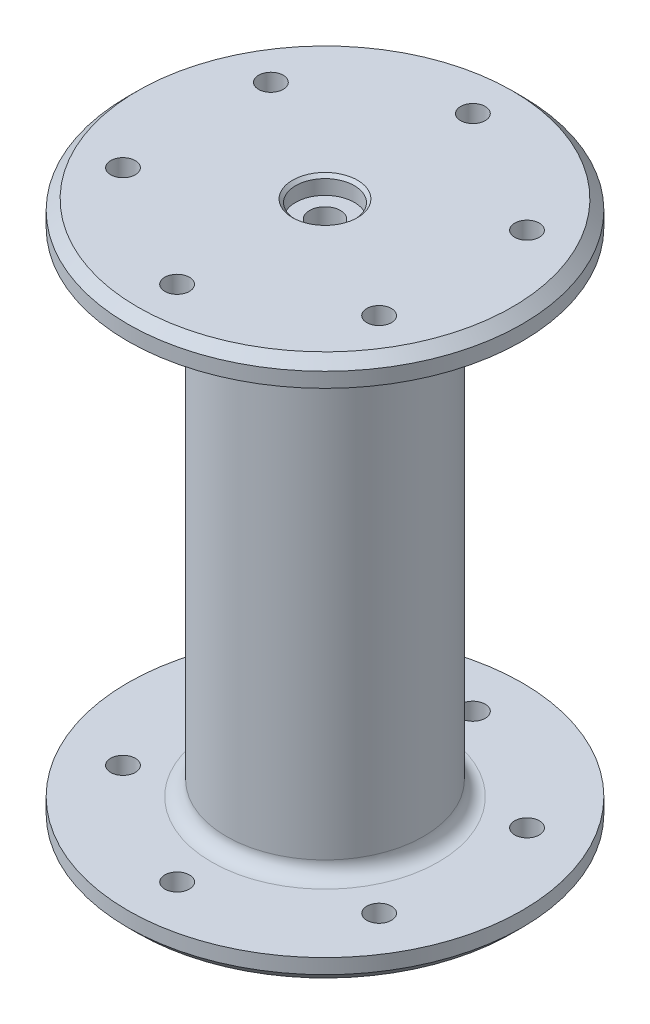
ISO-10303-21;
HEADER;
FILE_DESCRIPTION(('STEP AP214'),'2;1');
FILE_NAME('part.step','',(''),(''),'','','');
FILE_SCHEMA(('AUTOMOTIVE_DESIGN { 1 0 10303 214 1 1 1 1 }'));
ENDSEC;
DATA;
#1=APPLICATION_CONTEXT('core data for automotive mechanical design processes');
#2=APPLICATION_PROTOCOL_DEFINITION('international standard','automotive_design',2000,#1);
#3=PRODUCT_CONTEXT('',#1,'mechanical');
#4=PRODUCT('Part','Part','',(#3));
#5=PRODUCT_RELATED_PRODUCT_CATEGORY('part','',(#4));
#6=PRODUCT_DEFINITION_FORMATION('','',#4);
#7=PRODUCT_DEFINITION_CONTEXT('part definition',#1,'design');
#8=PRODUCT_DEFINITION('design','',#6,#7);
#9=PRODUCT_DEFINITION_SHAPE('','',#8);
#10=(LENGTH_UNIT() NAMED_UNIT(*) SI_UNIT(.MILLI.,.METRE.));
#11=(NAMED_UNIT(*) PLANE_ANGLE_UNIT() SI_UNIT($,.RADIAN.));
#12=(NAMED_UNIT(*) SI_UNIT($,.STERADIAN.) SOLID_ANGLE_UNIT());
#13=UNCERTAINTY_MEASURE_WITH_UNIT(LENGTH_MEASURE(1.E-05),#10,'distance_accuracy_value','');
#14=(GEOMETRIC_REPRESENTATION_CONTEXT(3) GLOBAL_UNCERTAINTY_ASSIGNED_CONTEXT((#13)) GLOBAL_UNIT_ASSIGNED_CONTEXT((#10,
#11,#12)) REPRESENTATION_CONTEXT('',''));
#15=CARTESIAN_POINT('',(0.,0.,0.));
#16=DIRECTION('',(0.,0.,1.));
#17=DIRECTION('',(1.,0.,0.));
#18=AXIS2_PLACEMENT_3D('',#15,#16,#17);
#19=CARTESIAN_POINT('',(0.,50.,0.));
#20=DIRECTION('',(0.,-1.,0.));
#21=DIRECTION('',(0.,0.,-1.));
#22=AXIS2_PLACEMENT_3D('',#19,#20,#21);
#23=CYLINDRICAL_SURFACE('',#22,20.);
#24=CARTESIAN_POINT('',(0.,-47.,0.));
#25=DIRECTION('',(0.,-1.,0.));
#26=DIRECTION('',(0.,0.,-1.));
#27=AXIS2_PLACEMENT_3D('',#24,#25,#26);
#28=CIRCLE('',#27,20.);
#29=CARTESIAN_POINT('',(0.,-47.,-20.));
#30=VERTEX_POINT('',#29);
#31=EDGE_CURVE('E46',#30,#30,#28,.F.);
#32=ORIENTED_EDGE('',*,*,#31,.T.);
#33=EDGE_LOOP('',(#32));
#34=FACE_BOUND('',#33,.T.);
#35=CARTESIAN_POINT('',(0.,47.,0.));
#36=DIRECTION('',(0.,1.,0.));
#37=DIRECTION('',(0.,0.,1.));
#38=AXIS2_PLACEMENT_3D('',#35,#36,#37);
#39=CIRCLE('',#38,20.);
#40=CARTESIAN_POINT('',(0.,47.,20.));
#41=VERTEX_POINT('',#40);
#42=EDGE_CURVE('E196',#41,#41,#39,.F.);
#43=ORIENTED_EDGE('',*,*,#42,.T.);
#44=EDGE_LOOP('',(#43));
#45=FACE_BOUND('',#44,.T.);
#46=ADVANCED_FACE('F37',(#34,#45),#23,.T.);
#47=CARTESIAN_POINT('',(0.,55.,0.));
#48=DIRECTION('',(0.,-1.,0.));
#49=DIRECTION('',(0.,0.,-1.));
#50=AXIS2_PLACEMENT_3D('',#47,#48,#49);
#51=CYLINDRICAL_SURFACE('',#50,40.);
#52=CARTESIAN_POINT('',(0.,53.,0.));
#53=DIRECTION('',(0.,1.,0.));
#54=DIRECTION('',(0.,0.,1.));
#55=AXIS2_PLACEMENT_3D('',#52,#53,#54);
#56=CIRCLE('',#55,40.);
#57=CARTESIAN_POINT('',(0.,53.,40.));
#58=VERTEX_POINT('',#57);
#59=EDGE_CURVE('E170',#58,#58,#56,.F.);
#60=ORIENTED_EDGE('',*,*,#59,.T.);
#61=EDGE_LOOP('',(#60));
#62=FACE_BOUND('',#61,.T.);
#63=CARTESIAN_POINT('',(0.,50.,0.));
#64=DIRECTION('',(0.,1.,0.));
#65=DIRECTION('',(0.,0.,1.));
#66=AXIS2_PLACEMENT_3D('',#63,#64,#65);
#67=CIRCLE('',#66,40.);
#68=CARTESIAN_POINT('',(0.,50.,40.));
#69=VERTEX_POINT('',#68);
#70=EDGE_CURVE('E162',#69,#69,#67,.T.);
#71=ORIENTED_EDGE('',*,*,#70,.T.);
#72=EDGE_LOOP('',(#71));
#73=FACE_BOUND('',#72,.T.);
#74=ADVANCED_FACE('F239',(#62,#73),#51,.T.);
#75=CARTESIAN_POINT('',(0.,55.,0.));
#76=DIRECTION('',(0.,1.,0.));
#77=DIRECTION('',(0.,0.,1.));
#78=AXIS2_PLACEMENT_3D('',#75,#76,#77);
#79=PLANE('',#78);
#80=CARTESIAN_POINT('',(0.,55.,0.));
#81=DIRECTION('',(0.,1.,0.));
#82=DIRECTION('',(0.,0.,1.));
#83=AXIS2_PLACEMENT_3D('',#80,#81,#82);
#84=CIRCLE('',#83,6.58876);
#85=CARTESIAN_POINT('',(0.,55.,6.58876));
#86=VERTEX_POINT('',#85);
#87=EDGE_CURVE('E120',#86,#86,#84,.T.);
#88=ORIENTED_EDGE('',*,*,#87,.F.);
#89=EDGE_LOOP('',(#88));
#90=FACE_BOUND('',#89,.T.);
#91=CARTESIAN_POINT('',(-25.980762113533,55.,-15.0000000000003));
#92=DIRECTION('',(0.,1.,0.));
#93=DIRECTION('',(0.,0.,1.));
#94=AXIS2_PLACEMENT_3D('',#91,#92,#93);
#95=CIRCLE('',#94,2.5);
#96=CARTESIAN_POINT('',(-25.980762113533,55.,-12.5000000000003));
#97=VERTEX_POINT('',#96);
#98=EDGE_CURVE('E153',#97,#97,#95,.F.);
#99=ORIENTED_EDGE('',*,*,#98,.T.);
#100=EDGE_LOOP('',(#99));
#101=FACE_BOUND('',#100,.T.);
#102=CARTESIAN_POINT('',(-25.9807621135333,55.,14.9999999999998));
#103=DIRECTION('',(0.,1.,0.));
#104=DIRECTION('',(0.,0.,1.));
#105=AXIS2_PLACEMENT_3D('',#102,#103,#104);
#106=CIRCLE('',#105,2.5);
#107=CARTESIAN_POINT('',(-25.9807621135333,55.,17.4999999999998));
#108=VERTEX_POINT('',#107);
#109=EDGE_CURVE('E148',#108,#108,#106,.F.);
#110=ORIENTED_EDGE('',*,*,#109,.T.);
#111=EDGE_LOOP('',(#110));
#112=FACE_BOUND('',#111,.T.);
#113=CARTESIAN_POINT('',(0.,55.,30.));
#114=DIRECTION('',(0.,1.,0.));
#115=DIRECTION('',(0.,0.,1.));
#116=AXIS2_PLACEMENT_3D('',#113,#114,#115);
#117=CIRCLE('',#116,2.5);
#118=CARTESIAN_POINT('',(0.,55.,32.5));
#119=VERTEX_POINT('',#118);
#120=EDGE_CURVE('E143',#119,#119,#117,.F.);
#121=ORIENTED_EDGE('',*,*,#120,.T.);
#122=EDGE_LOOP('',(#121));
#123=FACE_BOUND('',#122,.T.);
#124=CARTESIAN_POINT('',(25.9807621135331,55.,15.0000000000001));
#125=DIRECTION('',(0.,1.,0.));
#126=DIRECTION('',(0.,0.,1.));
#127=AXIS2_PLACEMENT_3D('',#124,#125,#126);
#128=CIRCLE('',#127,2.5);
#129=CARTESIAN_POINT('',(25.9807621135331,55.,17.5000000000001));
#130=VERTEX_POINT('',#129);
#131=EDGE_CURVE('E138',#130,#130,#128,.F.);
#132=ORIENTED_EDGE('',*,*,#131,.T.);
#133=EDGE_LOOP('',(#132));
#134=FACE_BOUND('',#133,.T.);
#135=CARTESIAN_POINT('',(25.9807621135332,55.,-14.9999999999999));
#136=DIRECTION('',(0.,1.,0.));
#137=DIRECTION('',(0.,0.,1.));
#138=AXIS2_PLACEMENT_3D('',#135,#136,#137);
#139=CIRCLE('',#138,2.5);
#140=CARTESIAN_POINT('',(25.9807621135332,55.,-12.4999999999999));
#141=VERTEX_POINT('',#140);
#142=EDGE_CURVE('E133',#141,#141,#139,.F.);
#143=ORIENTED_EDGE('',*,*,#142,.T.);
#144=EDGE_LOOP('',(#143));
#145=FACE_BOUND('',#144,.T.);
#146=CARTESIAN_POINT('',(0.,55.,-30.));
#147=DIRECTION('',(0.,1.,0.));
#148=DIRECTION('',(0.,0.,1.));
#149=AXIS2_PLACEMENT_3D('',#146,#147,#148);
#150=CIRCLE('',#149,2.5);
#151=CARTESIAN_POINT('',(0.,55.,-27.5));
#152=VERTEX_POINT('',#151);
#153=EDGE_CURVE('E158',#152,#152,#150,.F.);
#154=ORIENTED_EDGE('',*,*,#153,.T.);
#155=EDGE_LOOP('',(#154));
#156=FACE_BOUND('',#155,.T.);
#157=CARTESIAN_POINT('',(0.,55.,0.));
#158=DIRECTION('',(0.,1.,0.));
#159=DIRECTION('',(0.,0.,1.));
#160=AXIS2_PLACEMENT_3D('',#157,#158,#159);
#161=CIRCLE('',#160,38.);
#162=CARTESIAN_POINT('',(0.,55.,38.));
#163=VERTEX_POINT('',#162);
#164=EDGE_CURVE('E166',#163,#163,#161,.T.);
#165=ORIENTED_EDGE('',*,*,#164,.T.);
#166=EDGE_LOOP('',(#165));
#167=FACE_BOUND('',#166,.T.);
#168=ADVANCED_FACE('F245',(#90,#101,#112,#123,#134,#145,#156,#167),#79,.T.);
#169=CARTESIAN_POINT('',(0.,50.,0.));
#170=DIRECTION('',(0.,1.,0.));
#171=DIRECTION('',(0.,0.,1.));
#172=AXIS2_PLACEMENT_3D('',#169,#170,#171);
#173=PLANE('',#172);
#174=CARTESIAN_POINT('',(0.,50.,0.));
#175=DIRECTION('',(0.,1.,0.));
#176=DIRECTION('',(0.,0.,1.));
#177=AXIS2_PLACEMENT_3D('',#174,#175,#176);
#178=CIRCLE('',#177,23.);
#179=CARTESIAN_POINT('',(0.,50.,23.));
#180=VERTEX_POINT('',#179);
#181=EDGE_CURVE('E174',#180,#180,#178,.T.);
#182=ORIENTED_EDGE('',*,*,#181,.T.);
#183=EDGE_LOOP('',(#182));
#184=FACE_BOUND('',#183,.T.);
#185=CARTESIAN_POINT('',(-25.980762113533,50.,-15.0000000000003));
#186=DIRECTION('',(0.,1.,0.));
#187=DIRECTION('',(0.,0.,1.));
#188=AXIS2_PLACEMENT_3D('',#185,#186,#187);
#189=CIRCLE('',#188,2.5);
#190=CARTESIAN_POINT('',(-25.980762113533,50.,-12.5000000000003));
#191=VERTEX_POINT('',#190);
#192=EDGE_CURVE('E152',#191,#191,#189,.F.);
#193=ORIENTED_EDGE('',*,*,#192,.F.);
#194=EDGE_LOOP('',(#193));
#195=FACE_BOUND('',#194,.T.);
#196=CARTESIAN_POINT('',(-25.9807621135333,50.,14.9999999999998));
#197=DIRECTION('',(0.,1.,0.));
#198=DIRECTION('',(0.,0.,1.));
#199=AXIS2_PLACEMENT_3D('',#196,#197,#198);
#200=CIRCLE('',#199,2.5);
#201=CARTESIAN_POINT('',(-25.9807621135333,50.,17.4999999999998));
#202=VERTEX_POINT('',#201);
#203=EDGE_CURVE('E147',#202,#202,#200,.F.);
#204=ORIENTED_EDGE('',*,*,#203,.F.);
#205=EDGE_LOOP('',(#204));
#206=FACE_BOUND('',#205,.T.);
#207=CARTESIAN_POINT('',(0.,50.,30.));
#208=DIRECTION('',(0.,1.,0.));
#209=DIRECTION('',(0.,0.,1.));
#210=AXIS2_PLACEMENT_3D('',#207,#208,#209);
#211=CIRCLE('',#210,2.5);
#212=CARTESIAN_POINT('',(0.,50.,32.5));
#213=VERTEX_POINT('',#212);
#214=EDGE_CURVE('E142',#213,#213,#211,.F.);
#215=ORIENTED_EDGE('',*,*,#214,.F.);
#216=EDGE_LOOP('',(#215));
#217=FACE_BOUND('',#216,.T.);
#218=CARTESIAN_POINT('',(25.9807621135331,50.,15.0000000000001));
#219=DIRECTION('',(0.,1.,0.));
#220=DIRECTION('',(0.,0.,1.));
#221=AXIS2_PLACEMENT_3D('',#218,#219,#220);
#222=CIRCLE('',#221,2.5);
#223=CARTESIAN_POINT('',(25.9807621135331,50.,17.5000000000001));
#224=VERTEX_POINT('',#223);
#225=EDGE_CURVE('E137',#224,#224,#222,.F.);
#226=ORIENTED_EDGE('',*,*,#225,.F.);
#227=EDGE_LOOP('',(#226));
#228=FACE_BOUND('',#227,.T.);
#229=CARTESIAN_POINT('',(25.9807621135332,50.,-14.9999999999999));
#230=DIRECTION('',(0.,1.,0.));
#231=DIRECTION('',(0.,0.,1.));
#232=AXIS2_PLACEMENT_3D('',#229,#230,#231);
#233=CIRCLE('',#232,2.5);
#234=CARTESIAN_POINT('',(25.9807621135332,50.,-12.4999999999999));
#235=VERTEX_POINT('',#234);
#236=EDGE_CURVE('E132',#235,#235,#233,.F.);
#237=ORIENTED_EDGE('',*,*,#236,.F.);
#238=EDGE_LOOP('',(#237));
#239=FACE_BOUND('',#238,.T.);
#240=CARTESIAN_POINT('',(0.,50.,-30.));
#241=DIRECTION('',(0.,1.,0.));
#242=DIRECTION('',(0.,0.,1.));
#243=AXIS2_PLACEMENT_3D('',#240,#241,#242);
#244=CIRCLE('',#243,2.5);
#245=CARTESIAN_POINT('',(0.,50.,-27.5));
#246=VERTEX_POINT('',#245);
#247=EDGE_CURVE('E157',#246,#246,#244,.F.);
#248=ORIENTED_EDGE('',*,*,#247,.F.);
#249=EDGE_LOOP('',(#248));
#250=FACE_BOUND('',#249,.T.);
#251=ORIENTED_EDGE('',*,*,#70,.F.);
#252=EDGE_LOOP('',(#251));
#253=FACE_BOUND('',#252,.T.);
#254=ADVANCED_FACE('F255',(#184,#195,#206,#217,#228,#239,#250,#253),#173,.F.);
#255=CARTESIAN_POINT('',(0.,55.,0.));
#256=DIRECTION('',(0.,-1.,0.));
#257=DIRECTION('',(0.,0.,-1.));
#258=AXIS2_PLACEMENT_3D('',#255,#256,#257);
#259=CONICAL_SURFACE('',#258,38.,0.78539816339744);
#260=ORIENTED_EDGE('',*,*,#59,.F.);
#261=EDGE_LOOP('',(#260));
#262=FACE_BOUND('',#261,.T.);
#263=ORIENTED_EDGE('',*,*,#164,.F.);
#264=EDGE_LOOP('',(#263));
#265=FACE_BOUND('',#264,.T.);
#266=ADVANCED_FACE('F251',(#262,#265),#259,.T.);
#267=CARTESIAN_POINT('',(0.,450.,-30.));
#268=DIRECTION('',(0.,-1.,0.));
#269=DIRECTION('',(0.,0.,-1.));
#270=AXIS2_PLACEMENT_3D('',#267,#268,#269);
#271=CYLINDRICAL_SURFACE('',#270,2.5);
#272=ORIENTED_EDGE('',*,*,#153,.F.);
#273=EDGE_LOOP('',(#272));
#274=FACE_BOUND('',#273,.T.);
#275=ORIENTED_EDGE('',*,*,#247,.T.);
#276=EDGE_LOOP('',(#275));
#277=FACE_BOUND('',#276,.T.);
#278=ADVANCED_FACE('F254',(#274,#277),#271,.F.);
#279=CARTESIAN_POINT('',(25.9807621135332,450.,-14.9999999999999));
#280=DIRECTION('',(0.,-1.,0.));
#281=DIRECTION('',(0.,0.,-1.));
#282=AXIS2_PLACEMENT_3D('',#279,#280,#281);
#283=CYLINDRICAL_SURFACE('',#282,2.5);
#284=ORIENTED_EDGE('',*,*,#142,.F.);
#285=EDGE_LOOP('',(#284));
#286=FACE_BOUND('',#285,.T.);
#287=ORIENTED_EDGE('',*,*,#236,.T.);
#288=EDGE_LOOP('',(#287));
#289=FACE_BOUND('',#288,.T.);
#290=ADVANCED_FACE('F294',(#286,#289),#283,.F.);
#291=CARTESIAN_POINT('',(25.9807621135331,450.,15.0000000000001));
#292=DIRECTION('',(0.,-1.,0.));
#293=DIRECTION('',(0.,0.,-1.));
#294=AXIS2_PLACEMENT_3D('',#291,#292,#293);
#295=CYLINDRICAL_SURFACE('',#294,2.5);
#296=ORIENTED_EDGE('',*,*,#131,.F.);
#297=EDGE_LOOP('',(#296));
#298=FACE_BOUND('',#297,.T.);
#299=ORIENTED_EDGE('',*,*,#225,.T.);
#300=EDGE_LOOP('',(#299));
#301=FACE_BOUND('',#300,.T.);
#302=ADVANCED_FACE('F300',(#298,#301),#295,.F.);
#303=CARTESIAN_POINT('',(0.,450.,30.));
#304=DIRECTION('',(0.,-1.,0.));
#305=DIRECTION('',(0.,0.,-1.));
#306=AXIS2_PLACEMENT_3D('',#303,#304,#305);
#307=CYLINDRICAL_SURFACE('',#306,2.5);
#308=ORIENTED_EDGE('',*,*,#120,.F.);
#309=EDGE_LOOP('',(#308));
#310=FACE_BOUND('',#309,.T.);
#311=ORIENTED_EDGE('',*,*,#214,.T.);
#312=EDGE_LOOP('',(#311));
#313=FACE_BOUND('',#312,.T.);
#314=ADVANCED_FACE('F328',(#310,#313),#307,.F.);
#315=CARTESIAN_POINT('',(-25.9807621135333,450.,14.9999999999998));
#316=DIRECTION('',(0.,-1.,0.));
#317=DIRECTION('',(0.,0.,-1.));
#318=AXIS2_PLACEMENT_3D('',#315,#316,#317);
#319=CYLINDRICAL_SURFACE('',#318,2.5);
#320=ORIENTED_EDGE('',*,*,#109,.F.);
#321=EDGE_LOOP('',(#320));
#322=FACE_BOUND('',#321,.T.);
#323=ORIENTED_EDGE('',*,*,#203,.T.);
#324=EDGE_LOOP('',(#323));
#325=FACE_BOUND('',#324,.T.);
#326=ADVANCED_FACE('F269',(#322,#325),#319,.F.);
#327=CARTESIAN_POINT('',(-25.980762113533,450.,-15.0000000000003));
#328=DIRECTION('',(0.,-1.,0.));
#329=DIRECTION('',(0.,0.,-1.));
#330=AXIS2_PLACEMENT_3D('',#327,#328,#329);
#331=CYLINDRICAL_SURFACE('',#330,2.5);
#332=ORIENTED_EDGE('',*,*,#98,.F.);
#333=EDGE_LOOP('',(#332));
#334=FACE_BOUND('',#333,.T.);
#335=ORIENTED_EDGE('',*,*,#192,.T.);
#336=EDGE_LOOP('',(#335));
#337=FACE_BOUND('',#336,.T.);
#338=ADVANCED_FACE('F260',(#334,#337),#331,.F.);
#339=CARTESIAN_POINT('',(0.,47.,0.));
#340=DIRECTION('',(0.,1.,0.));
#341=DIRECTION('',(0.,0.,1.));
#342=AXIS2_PLACEMENT_3D('',#339,#340,#341);
#343=TOROIDAL_SURFACE('',#342,23.,3.);
#344=ORIENTED_EDGE('',*,*,#42,.F.);
#345=EDGE_LOOP('',(#344));
#346=FACE_BOUND('',#345,.T.);
#347=ORIENTED_EDGE('',*,*,#181,.F.);
#348=EDGE_LOOP('',(#347));
#349=FACE_BOUND('',#348,.T.);
#350=ADVANCED_FACE('F257',(#346,#349),#343,.F.);
#351=CARTESIAN_POINT('',(3.1242,51.4186,0.));
#352=DIRECTION('',(0.,-1.,0.));
#353=DIRECTION('',(0.,0.,-1.));
#354=AXIS2_PLACEMENT_3D('',#351,#352,#353);
#355=PLANE('',#354);
#356=CARTESIAN_POINT('',(0.,51.4186,0.));
#357=DIRECTION('',(0.,-1.,0.));
#358=DIRECTION('',(0.,0.,-1.));
#359=AXIS2_PLACEMENT_3D('',#356,#357,#358);
#360=CIRCLE('',#359,3.125);
#361=CARTESIAN_POINT('',(0.,51.4186,-3.125));
#362=VERTEX_POINT('',#361);
#363=EDGE_CURVE('E119',#362,#362,#360,.T.);
#364=ORIENTED_EDGE('',*,*,#363,.T.);
#365=EDGE_LOOP('',(#364));
#366=FACE_BOUND('',#365,.T.);
#367=CARTESIAN_POINT('',(0.,51.4186,0.));
#368=DIRECTION('',(0.,1.,0.));
#369=DIRECTION('',(0.,0.,1.));
#370=AXIS2_PLACEMENT_3D('',#367,#368,#369);
#371=CIRCLE('',#370,5.95376);
#372=CARTESIAN_POINT('',(0.,51.4186,5.95376));
#373=VERTEX_POINT('',#372);
#374=EDGE_CURVE('E128',#373,#373,#371,.T.);
#375=ORIENTED_EDGE('',*,*,#374,.T.);
#376=EDGE_LOOP('',(#375));
#377=FACE_BOUND('',#376,.T.);
#378=ADVANCED_FACE('F259',(#366,#377),#355,.F.);
#379=CARTESIAN_POINT('',(0.,55.,0.));
#380=DIRECTION('',(0.,1.,0.));
#381=DIRECTION('',(0.,0.,1.));
#382=AXIS2_PLACEMENT_3D('',#379,#380,#381);
#383=CYLINDRICAL_SURFACE('',#382,5.95376);
#384=ORIENTED_EDGE('',*,*,#374,.F.);
#385=EDGE_LOOP('',(#384));
#386=FACE_BOUND('',#385,.T.);
#387=CARTESIAN_POINT('',(0.,54.365,0.));
#388=DIRECTION('',(0.,1.,0.));
#389=DIRECTION('',(0.,0.,1.));
#390=AXIS2_PLACEMENT_3D('',#387,#388,#389);
#391=CIRCLE('',#390,5.95376);
#392=CARTESIAN_POINT('',(0.,54.365,5.95376));
#393=VERTEX_POINT('',#392);
#394=EDGE_CURVE('E124',#393,#393,#391,.T.);
#395=ORIENTED_EDGE('',*,*,#394,.T.);
#396=EDGE_LOOP('',(#395));
#397=FACE_BOUND('',#396,.T.);
#398=ADVANCED_FACE('F266',(#386,#397),#383,.F.);
#399=CARTESIAN_POINT('',(0.,55.,0.));
#400=DIRECTION('',(0.,1.,0.));
#401=DIRECTION('',(0.,0.,1.));
#402=AXIS2_PLACEMENT_3D('',#399,#400,#401);
#403=CONICAL_SURFACE('',#402,6.58876,0.785398163397445);
#404=ORIENTED_EDGE('',*,*,#394,.F.);
#405=EDGE_LOOP('',(#404));
#406=FACE_BOUND('',#405,.T.);
#407=ORIENTED_EDGE('',*,*,#87,.T.);
#408=EDGE_LOOP('',(#407));
#409=FACE_BOUND('',#408,.T.);
#410=ADVANCED_FACE('F234',(#406,#409),#403,.F.);
#411=CARTESIAN_POINT('',(0.,-50.,0.));
#412=DIRECTION('',(0.,1.,0.));
#413=DIRECTION('',(0.,0.,1.));
#414=AXIS2_PLACEMENT_3D('',#411,#412,#413);
#415=CYLINDRICAL_SURFACE('',#414,3.125);
#416=ORIENTED_EDGE('',*,*,#363,.F.);
#417=EDGE_LOOP('',(#416));
#418=FACE_BOUND('',#417,.T.);
#419=CARTESIAN_POINT('',(0.,-51.4186,0.));
#420=DIRECTION('',(0.,1.,0.));
#421=DIRECTION('',(0.,0.,1.));
#422=AXIS2_PLACEMENT_3D('',#419,#420,#421);
#423=CIRCLE('',#422,3.125);
#424=CARTESIAN_POINT('',(0.,-51.4186,3.125));
#425=VERTEX_POINT('',#424);
#426=EDGE_CURVE('E56',#425,#425,#423,.F.);
#427=ORIENTED_EDGE('',*,*,#426,.T.);
#428=EDGE_LOOP('',(#427));
#429=FACE_BOUND('',#428,.T.);
#430=ADVANCED_FACE('F225',(#418,#429),#415,.F.);
#431=CARTESIAN_POINT('',(0.,-50.,0.));
#432=DIRECTION('',(0.,-1.,0.));
#433=DIRECTION('',(0.,0.,1.));
#434=AXIS2_PLACEMENT_3D('',#431,#432,#433);
#435=PLANE('',#434);
#436=CARTESIAN_POINT('',(-25.980762113533,-50.,-15.0000000000003));
#437=DIRECTION('',(0.,-1.,0.));
#438=DIRECTION('',(0.,0.,-1.));
#439=AXIS2_PLACEMENT_3D('',#436,#437,#438);
#440=CIRCLE('',#439,2.5);
#441=CARTESIAN_POINT('',(-25.980762113533,-50.,-17.5000000000003));
#442=VERTEX_POINT('',#441);
#443=EDGE_CURVE('E66',#442,#442,#440,.T.);
#444=ORIENTED_EDGE('',*,*,#443,.T.);
#445=EDGE_LOOP('',(#444));
#446=FACE_BOUND('',#445,.T.);
#447=CARTESIAN_POINT('',(-25.9807621135333,-50.,14.9999999999998));
#448=DIRECTION('',(0.,-1.,0.));
#449=DIRECTION('',(0.,0.,-1.));
#450=AXIS2_PLACEMENT_3D('',#447,#448,#449);
#451=CIRCLE('',#450,2.5);
#452=CARTESIAN_POINT('',(-25.9807621135333,-50.,12.4999999999998));
#453=VERTEX_POINT('',#452);
#454=EDGE_CURVE('E84',#453,#453,#451,.T.);
#455=ORIENTED_EDGE('',*,*,#454,.T.);
#456=EDGE_LOOP('',(#455));
#457=FACE_BOUND('',#456,.T.);
#458=CARTESIAN_POINT('',(0.,-50.,30.));
#459=DIRECTION('',(0.,-1.,0.));
#460=DIRECTION('',(0.,0.,-1.));
#461=AXIS2_PLACEMENT_3D('',#458,#459,#460);
#462=CIRCLE('',#461,2.5);
#463=CARTESIAN_POINT('',(0.,-50.,27.5));
#464=VERTEX_POINT('',#463);
#465=EDGE_CURVE('E80',#464,#464,#462,.T.);
#466=ORIENTED_EDGE('',*,*,#465,.T.);
#467=EDGE_LOOP('',(#466));
#468=FACE_BOUND('',#467,.T.);
#469=CARTESIAN_POINT('',(25.9807621135331,-50.,15.0000000000001));
#470=DIRECTION('',(0.,-1.,0.));
#471=DIRECTION('',(0.,0.,-1.));
#472=AXIS2_PLACEMENT_3D('',#469,#470,#471);
#473=CIRCLE('',#472,2.5);
#474=CARTESIAN_POINT('',(25.9807621135331,-50.,12.5000000000001));
#475=VERTEX_POINT('',#474);
#476=EDGE_CURVE('E76',#475,#475,#473,.T.);
#477=ORIENTED_EDGE('',*,*,#476,.T.);
#478=EDGE_LOOP('',(#477));
#479=FACE_BOUND('',#478,.T.);
#480=CARTESIAN_POINT('',(25.9807621135332,-50.,-14.9999999999999));
#481=DIRECTION('',(0.,-1.,0.));
#482=DIRECTION('',(0.,0.,-1.));
#483=AXIS2_PLACEMENT_3D('',#480,#481,#482);
#484=CIRCLE('',#483,2.5);
#485=CARTESIAN_POINT('',(25.9807621135332,-50.,-17.4999999999999));
#486=VERTEX_POINT('',#485);
#487=EDGE_CURVE('E71',#486,#486,#484,.T.);
#488=ORIENTED_EDGE('',*,*,#487,.T.);
#489=EDGE_LOOP('',(#488));
#490=FACE_BOUND('',#489,.T.);
#491=CARTESIAN_POINT('',(0.,-50.,-30.));
#492=DIRECTION('',(0.,-1.,0.));
#493=DIRECTION('',(0.,0.,-1.));
#494=AXIS2_PLACEMENT_3D('',#491,#492,#493);
#495=CIRCLE('',#494,2.5);
#496=CARTESIAN_POINT('',(0.,-50.,-32.5));
#497=VERTEX_POINT('',#496);
#498=EDGE_CURVE('E61',#497,#497,#495,.T.);
#499=ORIENTED_EDGE('',*,*,#498,.T.);
#500=EDGE_LOOP('',(#499));
#501=FACE_BOUND('',#500,.T.);
#502=CARTESIAN_POINT('',(0.,-50.,0.));
#503=DIRECTION('',(0.,-1.,0.));
#504=DIRECTION('',(0.,0.,-1.));
#505=AXIS2_PLACEMENT_3D('',#502,#503,#504);
#506=CIRCLE('',#505,23.);
#507=CARTESIAN_POINT('',(0.,-50.,-23.));
#508=VERTEX_POINT('',#507);
#509=EDGE_CURVE('E10',#508,#508,#506,.T.);
#510=ORIENTED_EDGE('',*,*,#509,.T.);
#511=EDGE_LOOP('',(#510));
#512=FACE_BOUND('',#511,.T.);
#513=CARTESIAN_POINT('',(0.,-50.,0.));
#514=DIRECTION('',(0.,1.,0.));
#515=DIRECTION('',(0.,0.,1.));
#516=AXIS2_PLACEMENT_3D('',#513,#514,#515);
#517=CIRCLE('',#516,40.);
#518=CARTESIAN_POINT('',(0.,-50.,40.));
#519=VERTEX_POINT('',#518);
#520=EDGE_CURVE('E115',#519,#519,#517,.T.);
#521=ORIENTED_EDGE('',*,*,#520,.T.);
#522=EDGE_LOOP('',(#521));
#523=FACE_BOUND('',#522,.T.);
#524=ADVANCED_FACE('F223',(#446,#457,#468,#479,#490,#501,#512,#523),#435,.F.);
#525=CARTESIAN_POINT('',(0.,-55.,0.));
#526=DIRECTION('',(0.,-1.,0.));
#527=DIRECTION('',(0.,0.,1.));
#528=AXIS2_PLACEMENT_3D('',#525,#526,#527);
#529=PLANE('',#528);
#530=CARTESIAN_POINT('',(-25.980762113533,-55.,-15.0000000000003));
#531=DIRECTION('',(0.,-1.,0.));
#532=DIRECTION('',(0.,0.,-1.));
#533=AXIS2_PLACEMENT_3D('',#530,#531,#532);
#534=CIRCLE('',#533,2.5);
#535=CARTESIAN_POINT('',(-25.980762113533,-55.,-17.5000000000003));
#536=VERTEX_POINT('',#535);
#537=EDGE_CURVE('E41',#536,#536,#534,.T.);
#538=ORIENTED_EDGE('',*,*,#537,.F.);
#539=EDGE_LOOP('',(#538));
#540=FACE_BOUND('',#539,.T.);
#541=CARTESIAN_POINT('',(-25.9807621135333,-55.,14.9999999999998));
#542=DIRECTION('',(0.,-1.,0.));
#543=DIRECTION('',(0.,0.,-1.));
#544=AXIS2_PLACEMENT_3D('',#541,#542,#543);
#545=CIRCLE('',#544,2.5);
#546=CARTESIAN_POINT('',(-25.9807621135333,-55.,12.4999999999998));
#547=VERTEX_POINT('',#546);
#548=EDGE_CURVE('E81',#547,#547,#545,.T.);
#549=ORIENTED_EDGE('',*,*,#548,.F.);
#550=EDGE_LOOP('',(#549));
#551=FACE_BOUND('',#550,.T.);
#552=CARTESIAN_POINT('',(0.,-55.,30.));
#553=DIRECTION('',(0.,-1.,0.));
#554=DIRECTION('',(0.,0.,-1.));
#555=AXIS2_PLACEMENT_3D('',#552,#553,#554);
#556=CIRCLE('',#555,2.5);
#557=CARTESIAN_POINT('',(0.,-55.,27.5));
#558=VERTEX_POINT('',#557);
#559=EDGE_CURVE('E77',#558,#558,#556,.T.);
#560=ORIENTED_EDGE('',*,*,#559,.F.);
#561=EDGE_LOOP('',(#560));
#562=FACE_BOUND('',#561,.T.);
#563=CARTESIAN_POINT('',(25.9807621135331,-55.,15.0000000000001));
#564=DIRECTION('',(0.,-1.,0.));
#565=DIRECTION('',(0.,0.,-1.));
#566=AXIS2_PLACEMENT_3D('',#563,#564,#565);
#567=CIRCLE('',#566,2.5);
#568=CARTESIAN_POINT('',(25.9807621135331,-55.,12.5000000000001));
#569=VERTEX_POINT('',#568);
#570=EDGE_CURVE('E72',#569,#569,#567,.T.);
#571=ORIENTED_EDGE('',*,*,#570,.F.);
#572=EDGE_LOOP('',(#571));
#573=FACE_BOUND('',#572,.T.);
#574=CARTESIAN_POINT('',(25.9807621135332,-55.,-14.9999999999999));
#575=DIRECTION('',(0.,-1.,0.));
#576=DIRECTION('',(0.,0.,-1.));
#577=AXIS2_PLACEMENT_3D('',#574,#575,#576);
#578=CIRCLE('',#577,2.5);
#579=CARTESIAN_POINT('',(25.9807621135332,-55.,-17.4999999999999));
#580=VERTEX_POINT('',#579);
#581=EDGE_CURVE('E67',#580,#580,#578,.T.);
#582=ORIENTED_EDGE('',*,*,#581,.F.);
#583=EDGE_LOOP('',(#582));
#584=FACE_BOUND('',#583,.T.);
#585=CARTESIAN_POINT('',(0.,-55.,-30.));
#586=DIRECTION('',(0.,-1.,0.));
#587=DIRECTION('',(0.,0.,-1.));
#588=AXIS2_PLACEMENT_3D('',#585,#586,#587);
#589=CIRCLE('',#588,2.5);
#590=CARTESIAN_POINT('',(0.,-55.,-32.5));
#591=VERTEX_POINT('',#590);
#592=EDGE_CURVE('E62',#591,#591,#589,.T.);
#593=ORIENTED_EDGE('',*,*,#592,.F.);
#594=EDGE_LOOP('',(#593));
#595=FACE_BOUND('',#594,.T.);
#596=CARTESIAN_POINT('',(0.,-55.,0.));
#597=DIRECTION('',(0.,-1.,0.));
#598=DIRECTION('',(0.,0.,-1.));
#599=AXIS2_PLACEMENT_3D('',#596,#597,#598);
#600=CIRCLE('',#599,6.58876);
#601=CARTESIAN_POINT('',(0.,-55.,-6.58876));
#602=VERTEX_POINT('',#601);
#603=EDGE_CURVE('E60',#602,#602,#600,.T.);
#604=ORIENTED_EDGE('',*,*,#603,.F.);
#605=EDGE_LOOP('',(#604));
#606=FACE_BOUND('',#605,.T.);
#607=CARTESIAN_POINT('',(0.,-55.,0.));
#608=DIRECTION('',(0.,-1.,0.));
#609=DIRECTION('',(0.,0.,-1.));
#610=AXIS2_PLACEMENT_3D('',#607,#608,#609);
#611=CIRCLE('',#610,38.);
#612=CARTESIAN_POINT('',(0.,-55.,-38.));
#613=VERTEX_POINT('',#612);
#614=EDGE_CURVE('E52',#613,#613,#611,.T.);
#615=ORIENTED_EDGE('',*,*,#614,.T.);
#616=EDGE_LOOP('',(#615));
#617=FACE_BOUND('',#616,.T.);
#618=ADVANCED_FACE('F210',(#540,#551,#562,#573,#584,#595,#606,#617),#529,.T.);
#619=CARTESIAN_POINT('',(0.,-55.,0.));
#620=DIRECTION('',(0.,1.,0.));
#621=DIRECTION('',(0.,0.,1.));
#622=AXIS2_PLACEMENT_3D('',#619,#620,#621);
#623=CYLINDRICAL_SURFACE('',#622,40.);
#624=CARTESIAN_POINT('',(0.,-53.,0.));
#625=DIRECTION('',(0.,-1.,0.));
#626=DIRECTION('',(0.,0.,-1.));
#627=AXIS2_PLACEMENT_3D('',#624,#625,#626);
#628=CIRCLE('',#627,40.);
#629=CARTESIAN_POINT('',(0.,-53.,-40.));
#630=VERTEX_POINT('',#629);
#631=EDGE_CURVE('E200',#630,#630,#628,.F.);
#632=ORIENTED_EDGE('',*,*,#631,.T.);
#633=EDGE_LOOP('',(#632));
#634=FACE_BOUND('',#633,.T.);
#635=ORIENTED_EDGE('',*,*,#520,.F.);
#636=EDGE_LOOP('',(#635));
#637=FACE_BOUND('',#636,.T.);
#638=ADVANCED_FACE('F215',(#634,#637),#623,.T.);
#639=CARTESIAN_POINT('',(0.,-53.,0.));
#640=DIRECTION('',(0.,1.,0.));
#641=DIRECTION('',(0.,0.,1.));
#642=AXIS2_PLACEMENT_3D('',#639,#640,#641);
#643=CONICAL_SURFACE('',#642,40.,0.785398163397443);
#644=ORIENTED_EDGE('',*,*,#614,.F.);
#645=EDGE_LOOP('',(#644));
#646=FACE_BOUND('',#645,.T.);
#647=ORIENTED_EDGE('',*,*,#631,.F.);
#648=EDGE_LOOP('',(#647));
#649=FACE_BOUND('',#648,.T.);
#650=ADVANCED_FACE('F212',(#646,#649),#643,.T.);
#651=CARTESIAN_POINT('',(0.,-47.,0.));
#652=DIRECTION('',(0.,-1.,0.));
#653=DIRECTION('',(0.,0.,-1.));
#654=AXIS2_PLACEMENT_3D('',#651,#652,#653);
#655=TOROIDAL_SURFACE('',#654,23.,3.);
#656=ORIENTED_EDGE('',*,*,#509,.F.);
#657=EDGE_LOOP('',(#656));
#658=FACE_BOUND('',#657,.T.);
#659=ORIENTED_EDGE('',*,*,#31,.F.);
#660=EDGE_LOOP('',(#659));
#661=FACE_BOUND('',#660,.T.);
#662=ADVANCED_FACE('F39',(#658,#661),#655,.F.);
#663=CARTESIAN_POINT('',(3.1242,-51.4186,0.));
#664=DIRECTION('',(0.,1.,0.));
#665=DIRECTION('',(0.,0.,1.));
#666=AXIS2_PLACEMENT_3D('',#663,#664,#665);
#667=PLANE('',#666);
#668=ORIENTED_EDGE('',*,*,#426,.F.);
#669=EDGE_LOOP('',(#668));
#670=FACE_BOUND('',#669,.T.);
#671=CARTESIAN_POINT('',(0.,-51.4186,0.));
#672=DIRECTION('',(0.,-1.,0.));
#673=DIRECTION('',(0.,0.,-1.));
#674=AXIS2_PLACEMENT_3D('',#671,#672,#673);
#675=CIRCLE('',#674,5.95376);
#676=CARTESIAN_POINT('',(0.,-51.4186,-5.95376));
#677=VERTEX_POINT('',#676);
#678=EDGE_CURVE('E111',#677,#677,#675,.T.);
#679=ORIENTED_EDGE('',*,*,#678,.T.);
#680=EDGE_LOOP('',(#679));
#681=FACE_BOUND('',#680,.T.);
#682=ADVANCED_FACE('F422',(#670,#681),#667,.F.);
#683=CARTESIAN_POINT('',(0.,-55.,0.));
#684=DIRECTION('',(0.,-1.,0.));
#685=DIRECTION('',(0.,0.,-1.));
#686=AXIS2_PLACEMENT_3D('',#683,#684,#685);
#687=CYLINDRICAL_SURFACE('',#686,5.95376);
#688=ORIENTED_EDGE('',*,*,#678,.F.);
#689=EDGE_LOOP('',(#688));
#690=FACE_BOUND('',#689,.T.);
#691=CARTESIAN_POINT('',(0.,-54.365,0.));
#692=DIRECTION('',(0.,-1.,0.));
#693=DIRECTION('',(0.,0.,-1.));
#694=AXIS2_PLACEMENT_3D('',#691,#692,#693);
#695=CIRCLE('',#694,5.95376);
#696=CARTESIAN_POINT('',(0.,-54.365,-5.95376));
#697=VERTEX_POINT('',#696);
#698=EDGE_CURVE('E107',#697,#697,#695,.T.);
#699=ORIENTED_EDGE('',*,*,#698,.T.);
#700=EDGE_LOOP('',(#699));
#701=FACE_BOUND('',#700,.T.);
#702=ADVANCED_FACE('F431',(#690,#701),#687,.F.);
#703=CARTESIAN_POINT('',(0.,-55.,0.));
#704=DIRECTION('',(0.,-1.,0.));
#705=DIRECTION('',(0.,0.,-1.));
#706=AXIS2_PLACEMENT_3D('',#703,#704,#705);
#707=CONICAL_SURFACE('',#706,6.58876,0.785398163397445);
#708=ORIENTED_EDGE('',*,*,#698,.F.);
#709=EDGE_LOOP('',(#708));
#710=FACE_BOUND('',#709,.T.);
#711=ORIENTED_EDGE('',*,*,#603,.T.);
#712=EDGE_LOOP('',(#711));
#713=FACE_BOUND('',#712,.T.);
#714=ADVANCED_FACE('F441',(#710,#713),#707,.F.);
#715=CARTESIAN_POINT('',(0.,-450.,-30.));
#716=DIRECTION('',(0.,1.,0.));
#717=DIRECTION('',(0.,0.,1.));
#718=AXIS2_PLACEMENT_3D('',#715,#716,#717);
#719=CYLINDRICAL_SURFACE('',#718,2.5);
#720=ORIENTED_EDGE('',*,*,#592,.T.);
#721=EDGE_LOOP('',(#720));
#722=FACE_BOUND('',#721,.T.);
#723=ORIENTED_EDGE('',*,*,#498,.F.);
#724=EDGE_LOOP('',(#723));
#725=FACE_BOUND('',#724,.T.);
#726=ADVANCED_FACE('F449',(#722,#725),#719,.F.);
#727=CARTESIAN_POINT('',(25.9807621135332,-450.,-14.9999999999999));
#728=DIRECTION('',(0.,1.,0.));
#729=DIRECTION('',(0.,0.,1.));
#730=AXIS2_PLACEMENT_3D('',#727,#728,#729);
#731=CYLINDRICAL_SURFACE('',#730,2.5);
#732=ORIENTED_EDGE('',*,*,#581,.T.);
#733=EDGE_LOOP('',(#732));
#734=FACE_BOUND('',#733,.T.);
#735=ORIENTED_EDGE('',*,*,#487,.F.);
#736=EDGE_LOOP('',(#735));
#737=FACE_BOUND('',#736,.T.);
#738=ADVANCED_FACE('F468',(#734,#737),#731,.F.);
#739=CARTESIAN_POINT('',(25.9807621135331,-450.,15.0000000000001));
#740=DIRECTION('',(0.,1.,0.));
#741=DIRECTION('',(0.,0.,1.));
#742=AXIS2_PLACEMENT_3D('',#739,#740,#741);
#743=CYLINDRICAL_SURFACE('',#742,2.5);
#744=ORIENTED_EDGE('',*,*,#570,.T.);
#745=EDGE_LOOP('',(#744));
#746=FACE_BOUND('',#745,.T.);
#747=ORIENTED_EDGE('',*,*,#476,.F.);
#748=EDGE_LOOP('',(#747));
#749=FACE_BOUND('',#748,.T.);
#750=ADVANCED_FACE('F478',(#746,#749),#743,.F.);
#751=CARTESIAN_POINT('',(0.,-450.,30.));
#752=DIRECTION('',(0.,1.,0.));
#753=DIRECTION('',(0.,0.,1.));
#754=AXIS2_PLACEMENT_3D('',#751,#752,#753);
#755=CYLINDRICAL_SURFACE('',#754,2.5);
#756=ORIENTED_EDGE('',*,*,#559,.T.);
#757=EDGE_LOOP('',(#756));
#758=FACE_BOUND('',#757,.T.);
#759=ORIENTED_EDGE('',*,*,#465,.F.);
#760=EDGE_LOOP('',(#759));
#761=FACE_BOUND('',#760,.T.);
#762=ADVANCED_FACE('F488',(#758,#761),#755,.F.);
#763=CARTESIAN_POINT('',(-25.9807621135333,-450.,14.9999999999998));
#764=DIRECTION('',(0.,1.,0.));
#765=DIRECTION('',(0.,0.,1.));
#766=AXIS2_PLACEMENT_3D('',#763,#764,#765);
#767=CYLINDRICAL_SURFACE('',#766,2.5);
#768=ORIENTED_EDGE('',*,*,#548,.T.);
#769=EDGE_LOOP('',(#768));
#770=FACE_BOUND('',#769,.T.);
#771=ORIENTED_EDGE('',*,*,#454,.F.);
#772=EDGE_LOOP('',(#771));
#773=FACE_BOUND('',#772,.T.);
#774=ADVANCED_FACE('F498',(#770,#773),#767,.F.);
#775=CARTESIAN_POINT('',(-25.980762113533,-450.,-15.0000000000003));
#776=DIRECTION('',(0.,1.,0.));
#777=DIRECTION('',(0.,0.,1.));
#778=AXIS2_PLACEMENT_3D('',#775,#776,#777);
#779=CYLINDRICAL_SURFACE('',#778,2.5);
#780=ORIENTED_EDGE('',*,*,#537,.T.);
#781=EDGE_LOOP('',(#780));
#782=FACE_BOUND('',#781,.T.);
#783=ORIENTED_EDGE('',*,*,#443,.F.);
#784=EDGE_LOOP('',(#783));
#785=FACE_BOUND('',#784,.T.);
#786=ADVANCED_FACE('F508',(#782,#785),#779,.F.);
#787=CLOSED_SHELL('',(#46,#74,#168,#254,#266,#278,#290,#302,#314,#326,#338,#350,#378,#398,#410,
#430,#524,#618,#638,#650,#662,#682,#702,#714,#726,#738,#750,#762,#774,#786));
#788=MANIFOLD_SOLID_BREP('B2',#787);
#789=ADVANCED_BREP_SHAPE_REPRESENTATION('',(#18,#788),#14);
#790=SHAPE_DEFINITION_REPRESENTATION(#9,#789);
ENDSEC;
END-ISO-10303-21;
